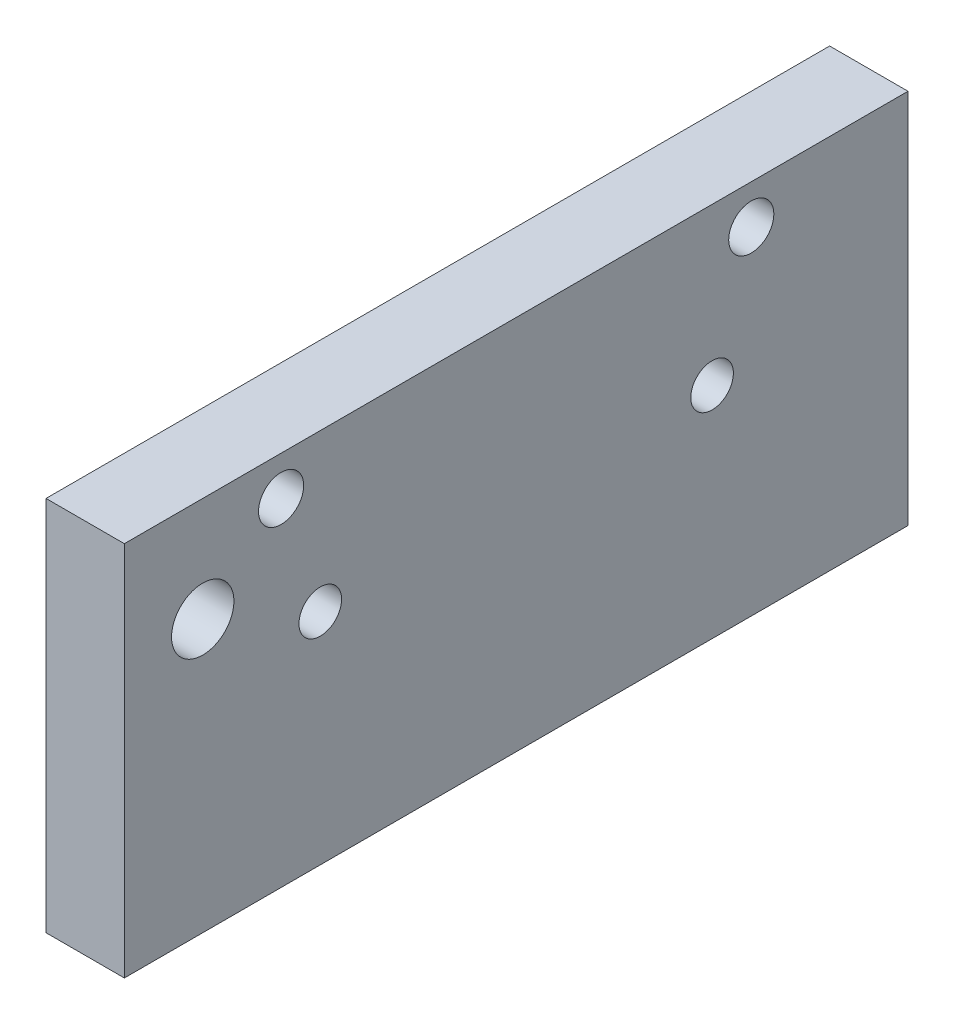
ISO-10303-21;
HEADER;
FILE_DESCRIPTION(('STEP AP214'),'2;1');
FILE_NAME('part.step','',(''),(''),'','','');
FILE_SCHEMA(('AUTOMOTIVE_DESIGN { 1 0 10303 214 1 1 1 1 }'));
ENDSEC;
DATA;
#1=APPLICATION_CONTEXT('core data for automotive mechanical design processes');
#2=APPLICATION_PROTOCOL_DEFINITION('international standard','automotive_design',2000,#1);
#3=PRODUCT_CONTEXT('',#1,'mechanical');
#4=PRODUCT('Part','Part','',(#3));
#5=PRODUCT_RELATED_PRODUCT_CATEGORY('part','',(#4));
#6=PRODUCT_DEFINITION_FORMATION('','',#4);
#7=PRODUCT_DEFINITION_CONTEXT('part definition',#1,'design');
#8=PRODUCT_DEFINITION('design','',#6,#7);
#9=PRODUCT_DEFINITION_SHAPE('','',#8);
#10=(LENGTH_UNIT() NAMED_UNIT(*) SI_UNIT(.MILLI.,.METRE.));
#11=(NAMED_UNIT(*) PLANE_ANGLE_UNIT() SI_UNIT($,.RADIAN.));
#12=(NAMED_UNIT(*) SI_UNIT($,.STERADIAN.) SOLID_ANGLE_UNIT());
#13=UNCERTAINTY_MEASURE_WITH_UNIT(LENGTH_MEASURE(1.E-05),#10,'distance_accuracy_value','');
#14=(GEOMETRIC_REPRESENTATION_CONTEXT(3) GLOBAL_UNCERTAINTY_ASSIGNED_CONTEXT((#13)) GLOBAL_UNIT_ASSIGNED_CONTEXT((#10,
#11,#12)) REPRESENTATION_CONTEXT('',''));
#15=CARTESIAN_POINT('',(0.,0.,0.));
#16=DIRECTION('',(0.,0.,1.));
#17=DIRECTION('',(1.,0.,0.));
#18=AXIS2_PLACEMENT_3D('',#15,#16,#17);
#19=CARTESIAN_POINT('',(0.,4.96112837408402,60.2648722985479));
#20=DIRECTION('',(1.,0.,0.));
#21=DIRECTION('',(0.,0.,-1.));
#22=AXIS2_PLACEMENT_3D('',#19,#20,#21);
#23=PLANE('',#22);
#24=CARTESIAN_POINT('',(0.,26.9744617074174,53.9148722985479));
#25=DIRECTION('',(-1.,0.,0.));
#26=DIRECTION('',(0.,0.,1.));
#27=AXIS2_PLACEMENT_3D('',#24,#25,#26);
#28=CIRCLE('',#27,2.5273);
#29=CARTESIAN_POINT('',(0.,26.9744617074174,56.4421722985479));
#30=VERTEX_POINT('',#29);
#31=EDGE_CURVE('E135',#30,#30,#28,.T.);
#32=ORIENTED_EDGE('',*,*,#31,.F.);
#33=EDGE_LOOP('',(#32));
#34=FACE_BOUND('',#33,.T.);
#35=CARTESIAN_POINT('',(0.,32.266128374084,47.5648722985479));
#36=DIRECTION('',(-1.,0.,0.));
#37=DIRECTION('',(0.,0.,1.));
#38=AXIS2_PLACEMENT_3D('',#35,#36,#37);
#39=CIRCLE('',#38,1.82879999999998);
#40=CARTESIAN_POINT('',(0.,32.266128374084,49.3936722985479));
#41=VERTEX_POINT('',#40);
#42=EDGE_CURVE('E123',#41,#41,#39,.T.);
#43=ORIENTED_EDGE('',*,*,#42,.F.);
#44=EDGE_LOOP('',(#43));
#45=FACE_BOUND('',#44,.T.);
#46=CARTESIAN_POINT('',(0.,22.741128374084,12.6398722985479));
#47=DIRECTION('',(-1.,0.,0.));
#48=DIRECTION('',(0.,0.,1.));
#49=AXIS2_PLACEMENT_3D('',#46,#47,#48);
#50=CIRCLE('',#49,1.7272);
#51=CARTESIAN_POINT('',(0.,22.741128374084,14.3670722985479));
#52=VERTEX_POINT('',#51);
#53=EDGE_CURVE('E117',#52,#52,#50,.T.);
#54=ORIENTED_EDGE('',*,*,#53,.F.);
#55=EDGE_LOOP('',(#54));
#56=FACE_BOUND('',#55,.T.);
#57=CARTESIAN_POINT('',(0.,22.741128374084,44.3898722985479));
#58=DIRECTION('',(-1.,0.,0.));
#59=DIRECTION('',(0.,0.,1.));
#60=AXIS2_PLACEMENT_3D('',#57,#58,#59);
#61=CIRCLE('',#60,1.7272);
#62=CARTESIAN_POINT('',(0.,22.741128374084,46.1170722985479));
#63=VERTEX_POINT('',#62);
#64=EDGE_CURVE('E111',#63,#63,#61,.T.);
#65=ORIENTED_EDGE('',*,*,#64,.F.);
#66=EDGE_LOOP('',(#65));
#67=FACE_BOUND('',#66,.T.);
#68=DIRECTION('',(0.,-1.,0.));
#69=VECTOR('',#68,1.);
#70=CARTESIAN_POINT('',(0.,35.441128374084,60.2648722985479));
#71=LINE('',#70,#69);
#72=CARTESIAN_POINT('',(0.,35.441128374084,60.2648722985479));
#73=VERTEX_POINT('',#72);
#74=CARTESIAN_POINT('',(0.,4.96112837408402,60.2648722985479));
#75=VERTEX_POINT('',#74);
#76=EDGE_CURVE('E95',#73,#75,#71,.T.);
#77=ORIENTED_EDGE('',*,*,#76,.F.);
#78=DIRECTION('',(0.,0.,1.));
#79=VECTOR('',#78,1.);
#80=CARTESIAN_POINT('',(0.,35.441128374084,60.2648722985479));
#81=LINE('',#80,#79);
#82=CARTESIAN_POINT('',(0.,35.441128374084,-3.23512770145205));
#83=VERTEX_POINT('',#82);
#84=EDGE_CURVE('E71',#83,#73,#81,.T.);
#85=ORIENTED_EDGE('',*,*,#84,.F.);
#86=DIRECTION('',(0.,1.,0.));
#87=VECTOR('',#86,1.);
#88=CARTESIAN_POINT('',(0.,35.441128374084,-3.23512770145205));
#89=LINE('',#88,#87);
#90=CARTESIAN_POINT('',(0.,4.96112837408402,-3.23512770145207));
#91=VERTEX_POINT('',#90);
#92=EDGE_CURVE('E65',#91,#83,#89,.T.);
#93=ORIENTED_EDGE('',*,*,#92,.F.);
#94=DIRECTION('',(0.,0.,-1.));
#95=VECTOR('',#94,1.);
#96=CARTESIAN_POINT('',(0.,4.96112837408402,60.2648722985479));
#97=LINE('',#96,#95);
#98=EDGE_CURVE('E87',#75,#91,#97,.T.);
#99=ORIENTED_EDGE('',*,*,#98,.F.);
#100=EDGE_LOOP('',(#77,#85,#93,#99));
#101=FACE_BOUND('',#100,.T.);
#102=CARTESIAN_POINT('',(0.,32.266128374084,9.46487229854794));
#103=DIRECTION('',(-1.,0.,0.));
#104=DIRECTION('',(0.,0.,1.));
#105=AXIS2_PLACEMENT_3D('',#102,#103,#104);
#106=CIRCLE('',#105,1.82879999999999);
#107=CARTESIAN_POINT('',(0.,32.266128374084,11.2936722985479));
#108=VERTEX_POINT('',#107);
#109=EDGE_CURVE('E129',#108,#108,#106,.T.);
#110=ORIENTED_EDGE('',*,*,#109,.F.);
#111=EDGE_LOOP('',(#110));
#112=FACE_BOUND('',#111,.T.);
#113=ADVANCED_FACE('F31',(#34,#45,#56,#67,#101,#112),#23,.F.);
#114=CARTESIAN_POINT('',(6.35,35.441128374084,60.2648722985479));
#115=DIRECTION('',(0.,0.,-1.));
#116=DIRECTION('',(0.,1.,0.));
#117=AXIS2_PLACEMENT_3D('',#114,#115,#116);
#118=PLANE('',#117);
#119=ORIENTED_EDGE('',*,*,#76,.T.);
#120=DIRECTION('',(-1.,0.,0.));
#121=VECTOR('',#120,1.);
#122=CARTESIAN_POINT('',(6.35,4.96112837408402,60.2648722985479));
#123=LINE('',#122,#121);
#124=CARTESIAN_POINT('',(6.35,4.96112837408402,60.2648722985479));
#125=VERTEX_POINT('',#124);
#126=EDGE_CURVE('E11',#125,#75,#123,.T.);
#127=ORIENTED_EDGE('',*,*,#126,.F.);
#128=DIRECTION('',(0.,-1.,0.));
#129=VECTOR('',#128,1.);
#130=CARTESIAN_POINT('',(6.35,35.441128374084,60.2648722985479));
#131=LINE('',#130,#129);
#132=CARTESIAN_POINT('',(6.35,35.441128374084,60.2648722985479));
#133=VERTEX_POINT('',#132);
#134=EDGE_CURVE('E83',#133,#125,#131,.T.);
#135=ORIENTED_EDGE('',*,*,#134,.F.);
#136=DIRECTION('',(-1.,0.,0.));
#137=VECTOR('',#136,1.);
#138=CARTESIAN_POINT('',(6.35,35.441128374084,60.2648722985479));
#139=LINE('',#138,#137);
#140=EDGE_CURVE('E91',#133,#73,#139,.T.);
#141=ORIENTED_EDGE('',*,*,#140,.T.);
#142=EDGE_LOOP('',(#119,#127,#135,#141));
#143=FACE_BOUND('',#142,.T.);
#144=ADVANCED_FACE('F33',(#143),#118,.F.);
#145=CARTESIAN_POINT('',(6.35,4.96112837408402,60.2648722985479));
#146=DIRECTION('',(0.,1.,0.));
#147=DIRECTION('',(0.,0.,1.));
#148=AXIS2_PLACEMENT_3D('',#145,#146,#147);
#149=PLANE('',#148);
#150=ORIENTED_EDGE('',*,*,#98,.T.);
#151=DIRECTION('',(-1.,0.,0.));
#152=VECTOR('',#151,1.);
#153=CARTESIAN_POINT('',(6.35,4.96112837408402,-3.23512770145207));
#154=LINE('',#153,#152);
#155=CARTESIAN_POINT('',(6.35,4.96112837408402,-3.23512770145207));
#156=VERTEX_POINT('',#155);
#157=EDGE_CURVE('E40',#156,#91,#154,.T.);
#158=ORIENTED_EDGE('',*,*,#157,.F.);
#159=DIRECTION('',(0.,0.,-1.));
#160=VECTOR('',#159,1.);
#161=CARTESIAN_POINT('',(6.35,4.96112837408402,60.2648722985479));
#162=LINE('',#161,#160);
#163=EDGE_CURVE('E78',#125,#156,#162,.T.);
#164=ORIENTED_EDGE('',*,*,#163,.F.);
#165=ORIENTED_EDGE('',*,*,#126,.T.);
#166=EDGE_LOOP('',(#150,#158,#164,#165));
#167=FACE_BOUND('',#166,.T.);
#168=ADVANCED_FACE('F86',(#167),#149,.F.);
#169=CARTESIAN_POINT('',(6.35,35.441128374084,-3.23512770145205));
#170=DIRECTION('',(0.,0.,1.));
#171=DIRECTION('',(0.,-1.,0.));
#172=AXIS2_PLACEMENT_3D('',#169,#170,#171);
#173=PLANE('',#172);
#174=ORIENTED_EDGE('',*,*,#92,.T.);
#175=DIRECTION('',(-1.,0.,0.));
#176=VECTOR('',#175,1.);
#177=CARTESIAN_POINT('',(6.35,35.441128374084,-3.23512770145205));
#178=LINE('',#177,#176);
#179=CARTESIAN_POINT('',(6.35,35.441128374084,-3.23512770145205));
#180=VERTEX_POINT('',#179);
#181=EDGE_CURVE('E88',#180,#83,#178,.T.);
#182=ORIENTED_EDGE('',*,*,#181,.F.);
#183=DIRECTION('',(0.,1.,0.));
#184=VECTOR('',#183,1.);
#185=CARTESIAN_POINT('',(6.35,35.441128374084,-3.23512770145205));
#186=LINE('',#185,#184);
#187=EDGE_CURVE('E81',#156,#180,#186,.T.);
#188=ORIENTED_EDGE('',*,*,#187,.F.);
#189=ORIENTED_EDGE('',*,*,#157,.T.);
#190=EDGE_LOOP('',(#174,#182,#188,#189));
#191=FACE_BOUND('',#190,.T.);
#192=ADVANCED_FACE('F89',(#191),#173,.F.);
#193=CARTESIAN_POINT('',(6.35,35.441128374084,60.2648722985479));
#194=DIRECTION('',(0.,-1.,0.));
#195=DIRECTION('',(0.,0.,-1.));
#196=AXIS2_PLACEMENT_3D('',#193,#194,#195);
#197=PLANE('',#196);
#198=ORIENTED_EDGE('',*,*,#84,.T.);
#199=ORIENTED_EDGE('',*,*,#140,.F.);
#200=DIRECTION('',(0.,0.,1.));
#201=VECTOR('',#200,1.);
#202=CARTESIAN_POINT('',(6.35,35.441128374084,60.2648722985479));
#203=LINE('',#202,#201);
#204=EDGE_CURVE('E48',#180,#133,#203,.T.);
#205=ORIENTED_EDGE('',*,*,#204,.F.);
#206=ORIENTED_EDGE('',*,*,#181,.T.);
#207=EDGE_LOOP('',(#198,#199,#205,#206));
#208=FACE_BOUND('',#207,.T.);
#209=ADVANCED_FACE('F103',(#208),#197,.F.);
#210=CARTESIAN_POINT('',(6.35,4.96112837408402,60.2648722985479));
#211=DIRECTION('',(1.,0.,0.));
#212=DIRECTION('',(0.,0.,-1.));
#213=AXIS2_PLACEMENT_3D('',#210,#211,#212);
#214=PLANE('',#213);
#215=CARTESIAN_POINT('',(6.35,26.9744617074174,53.9148722985479));
#216=DIRECTION('',(-1.,0.,0.));
#217=DIRECTION('',(0.,0.,1.));
#218=AXIS2_PLACEMENT_3D('',#215,#216,#217);
#219=CIRCLE('',#218,2.5273);
#220=CARTESIAN_POINT('',(6.35,26.9744617074174,56.4421722985479));
#221=VERTEX_POINT('',#220);
#222=EDGE_CURVE('E132',#221,#221,#219,.T.);
#223=ORIENTED_EDGE('',*,*,#222,.T.);
#224=EDGE_LOOP('',(#223));
#225=FACE_BOUND('',#224,.T.);
#226=CARTESIAN_POINT('',(6.35,32.266128374084,9.46487229854794));
#227=DIRECTION('',(1.,0.,0.));
#228=DIRECTION('',(0.,0.,-1.));
#229=AXIS2_PLACEMENT_3D('',#226,#227,#228);
#230=CIRCLE('',#229,1.8288);
#231=CARTESIAN_POINT('',(6.35,32.266128374084,7.63607229854794));
#232=VERTEX_POINT('',#231);
#233=EDGE_CURVE('E126',#232,#232,#230,.T.);
#234=ORIENTED_EDGE('',*,*,#233,.F.);
#235=EDGE_LOOP('',(#234));
#236=FACE_BOUND('',#235,.T.);
#237=CARTESIAN_POINT('',(6.35,32.266128374084,47.5648722985479));
#238=DIRECTION('',(1.,0.,0.));
#239=DIRECTION('',(0.,0.,-1.));
#240=AXIS2_PLACEMENT_3D('',#237,#238,#239);
#241=CIRCLE('',#240,1.82879999999999);
#242=CARTESIAN_POINT('',(6.35,32.266128374084,45.7360722985479));
#243=VERTEX_POINT('',#242);
#244=EDGE_CURVE('E120',#243,#243,#241,.T.);
#245=ORIENTED_EDGE('',*,*,#244,.F.);
#246=EDGE_LOOP('',(#245));
#247=FACE_BOUND('',#246,.T.);
#248=CARTESIAN_POINT('',(6.35,22.741128374084,12.6398722985479));
#249=DIRECTION('',(-1.,0.,0.));
#250=DIRECTION('',(0.,0.,1.));
#251=AXIS2_PLACEMENT_3D('',#248,#249,#250);
#252=CIRCLE('',#251,1.7272);
#253=CARTESIAN_POINT('',(6.35,22.741128374084,14.3670722985479));
#254=VERTEX_POINT('',#253);
#255=EDGE_CURVE('E114',#254,#254,#252,.T.);
#256=ORIENTED_EDGE('',*,*,#255,.T.);
#257=EDGE_LOOP('',(#256));
#258=FACE_BOUND('',#257,.T.);
#259=CARTESIAN_POINT('',(6.35,22.741128374084,44.3898722985479));
#260=DIRECTION('',(-1.,0.,0.));
#261=DIRECTION('',(0.,0.,1.));
#262=AXIS2_PLACEMENT_3D('',#259,#260,#261);
#263=CIRCLE('',#262,1.7272);
#264=CARTESIAN_POINT('',(6.35,22.741128374084,46.1170722985479));
#265=VERTEX_POINT('',#264);
#266=EDGE_CURVE('E98',#265,#265,#263,.T.);
#267=ORIENTED_EDGE('',*,*,#266,.T.);
#268=EDGE_LOOP('',(#267));
#269=FACE_BOUND('',#268,.T.);
#270=ORIENTED_EDGE('',*,*,#134,.T.);
#271=ORIENTED_EDGE('',*,*,#163,.T.);
#272=ORIENTED_EDGE('',*,*,#187,.T.);
#273=ORIENTED_EDGE('',*,*,#204,.T.);
#274=EDGE_LOOP('',(#270,#271,#272,#273));
#275=FACE_BOUND('',#274,.T.);
#276=ADVANCED_FACE('F79',(#225,#236,#247,#258,#269,#275),#214,.T.);
#277=CARTESIAN_POINT('',(0.,22.741128374084,44.3898722985479));
#278=DIRECTION('',(-1.,0.,0.));
#279=DIRECTION('',(0.,0.,1.));
#280=AXIS2_PLACEMENT_3D('',#277,#278,#279);
#281=CYLINDRICAL_SURFACE('',#280,1.7272);
#282=ORIENTED_EDGE('',*,*,#266,.F.);
#283=EDGE_LOOP('',(#282));
#284=FACE_BOUND('',#283,.T.);
#285=ORIENTED_EDGE('',*,*,#64,.T.);
#286=EDGE_LOOP('',(#285));
#287=FACE_BOUND('',#286,.T.);
#288=ADVANCED_FACE('F150',(#284,#287),#281,.F.);
#289=CARTESIAN_POINT('',(0.,22.741128374084,12.6398722985479));
#290=DIRECTION('',(-1.,0.,0.));
#291=DIRECTION('',(0.,0.,1.));
#292=AXIS2_PLACEMENT_3D('',#289,#290,#291);
#293=CYLINDRICAL_SURFACE('',#292,1.7272);
#294=ORIENTED_EDGE('',*,*,#255,.F.);
#295=EDGE_LOOP('',(#294));
#296=FACE_BOUND('',#295,.T.);
#297=ORIENTED_EDGE('',*,*,#53,.T.);
#298=EDGE_LOOP('',(#297));
#299=FACE_BOUND('',#298,.T.);
#300=ADVANCED_FACE('F152',(#296,#299),#293,.F.);
#301=CARTESIAN_POINT('',(0.,32.266128374084,47.5648722985479));
#302=DIRECTION('',(-1.,0.,0.));
#303=DIRECTION('',(0.,0.,1.));
#304=AXIS2_PLACEMENT_3D('',#301,#302,#303);
#305=CYLINDRICAL_SURFACE('',#304,1.82879999999999);
#306=ORIENTED_EDGE('',*,*,#42,.T.);
#307=EDGE_LOOP('',(#306));
#308=FACE_BOUND('',#307,.T.);
#309=ORIENTED_EDGE('',*,*,#244,.T.);
#310=EDGE_LOOP('',(#309));
#311=FACE_BOUND('',#310,.T.);
#312=ADVANCED_FACE('F159',(#308,#311),#305,.F.);
#313=CARTESIAN_POINT('',(0.,32.266128374084,9.46487229854794));
#314=DIRECTION('',(-1.,0.,0.));
#315=DIRECTION('',(0.,0.,1.));
#316=AXIS2_PLACEMENT_3D('',#313,#314,#315);
#317=CYLINDRICAL_SURFACE('',#316,1.8288);
#318=ORIENTED_EDGE('',*,*,#109,.T.);
#319=EDGE_LOOP('',(#318));
#320=FACE_BOUND('',#319,.T.);
#321=ORIENTED_EDGE('',*,*,#233,.T.);
#322=EDGE_LOOP('',(#321));
#323=FACE_BOUND('',#322,.T.);
#324=ADVANCED_FACE('F188',(#320,#323),#317,.F.);
#325=CARTESIAN_POINT('',(0.,26.9744617074174,53.9148722985479));
#326=DIRECTION('',(-1.,0.,0.));
#327=DIRECTION('',(0.,0.,1.));
#328=AXIS2_PLACEMENT_3D('',#325,#326,#327);
#329=CYLINDRICAL_SURFACE('',#328,2.5273);
#330=ORIENTED_EDGE('',*,*,#222,.F.);
#331=EDGE_LOOP('',(#330));
#332=FACE_BOUND('',#331,.T.);
#333=ORIENTED_EDGE('',*,*,#31,.T.);
#334=EDGE_LOOP('',(#333));
#335=FACE_BOUND('',#334,.T.);
#336=ADVANCED_FACE('F139',(#332,#335),#329,.F.);
#337=CLOSED_SHELL('',(#113,#144,#168,#192,#209,#276,#288,#300,#312,#324,#336));
#338=MANIFOLD_SOLID_BREP('B2',#337);
#339=ADVANCED_BREP_SHAPE_REPRESENTATION('',(#18,#338),#14);
#340=SHAPE_DEFINITION_REPRESENTATION(#9,#339);
ENDSEC;
END-ISO-10303-21;
